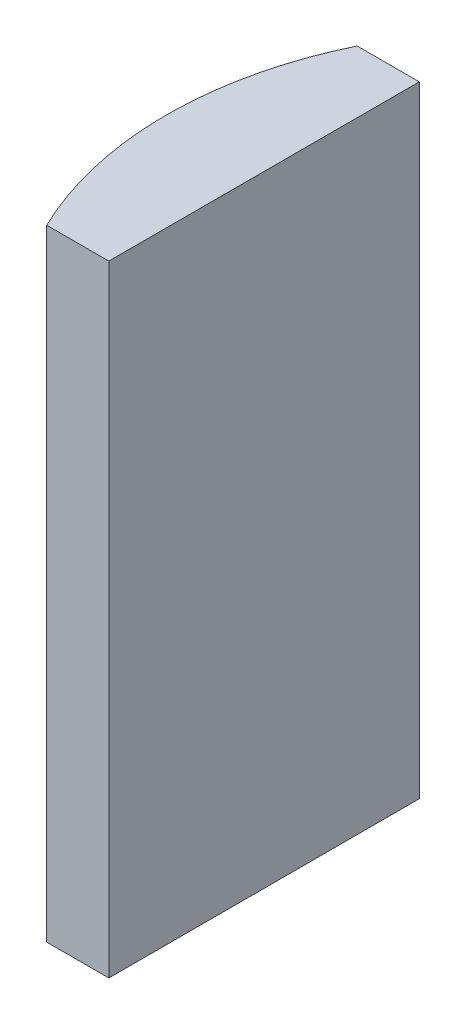
ISO-10303-21;
HEADER;
FILE_DESCRIPTION(('STEP AP214'),'2;1');
FILE_NAME('part.step','',(''),(''),'','','');
FILE_SCHEMA(('AUTOMOTIVE_DESIGN { 1 0 10303 214 1 1 1 1 }'));
ENDSEC;
DATA;
#1=APPLICATION_CONTEXT('core data for automotive mechanical design processes');
#2=APPLICATION_PROTOCOL_DEFINITION('international standard','automotive_design',2000,#1);
#3=PRODUCT_CONTEXT('',#1,'mechanical');
#4=PRODUCT('Part','Part','',(#3));
#5=PRODUCT_RELATED_PRODUCT_CATEGORY('part','',(#4));
#6=PRODUCT_DEFINITION_FORMATION('','',#4);
#7=PRODUCT_DEFINITION_CONTEXT('part definition',#1,'design');
#8=PRODUCT_DEFINITION('design','',#6,#7);
#9=PRODUCT_DEFINITION_SHAPE('','',#8);
#10=(LENGTH_UNIT() NAMED_UNIT(*) SI_UNIT(.MILLI.,.METRE.));
#11=(NAMED_UNIT(*) PLANE_ANGLE_UNIT() SI_UNIT($,.RADIAN.));
#12=(NAMED_UNIT(*) SI_UNIT($,.STERADIAN.) SOLID_ANGLE_UNIT());
#13=UNCERTAINTY_MEASURE_WITH_UNIT(LENGTH_MEASURE(1.E-05),#10,'distance_accuracy_value','');
#14=(GEOMETRIC_REPRESENTATION_CONTEXT(3) GLOBAL_UNCERTAINTY_ASSIGNED_CONTEXT((#13)) GLOBAL_UNIT_ASSIGNED_CONTEXT((#10,
#11,#12)) REPRESENTATION_CONTEXT('',''));
#15=CARTESIAN_POINT('',(0.,0.,0.));
#16=DIRECTION('',(0.,0.,1.));
#17=DIRECTION('',(1.,0.,0.));
#18=AXIS2_PLACEMENT_3D('',#15,#16,#17);
#19=CARTESIAN_POINT('',(4.35520433485127,20.,0.));
#20=DIRECTION('',(0.,-1.,0.));
#21=DIRECTION('',(0.,0.,-1.));
#22=AXIS2_PLACEMENT_3D('',#19,#20,#21);
#23=CYLINDRICAL_SURFACE('',#22,11.45);
#24=CARTESIAN_POINT('',(4.35520433485127,0.,0.));
#25=DIRECTION('',(0.,1.,0.));
#26=DIRECTION('',(0.,0.,1.));
#27=AXIS2_PLACEMENT_3D('',#24,#25,#26);
#28=CIRCLE('',#27,11.45);
#29=CARTESIAN_POINT('',(-5.94540244339243,0.,-5.));
#30=VERTEX_POINT('',#29);
#31=CARTESIAN_POINT('',(-5.94540244339243,0.,5.));
#32=VERTEX_POINT('',#31);
#33=EDGE_CURVE('E100',#30,#32,#28,.T.);
#34=ORIENTED_EDGE('',*,*,#33,.T.);
#35=DIRECTION('',(0.,-1.,0.));
#36=VECTOR('',#35,1.);
#37=CARTESIAN_POINT('',(-5.94540244339243,20.,5.));
#38=LINE('',#37,#36);
#39=CARTESIAN_POINT('',(-5.94540244339243,20.,5.));
#40=VERTEX_POINT('',#39);
#41=EDGE_CURVE('E11',#40,#32,#38,.T.);
#42=ORIENTED_EDGE('',*,*,#41,.F.);
#43=CARTESIAN_POINT('',(4.35520433485127,20.,0.));
#44=DIRECTION('',(0.,1.,0.));
#45=DIRECTION('',(0.,0.,1.));
#46=AXIS2_PLACEMENT_3D('',#43,#44,#45);
#47=CIRCLE('',#46,11.45);
#48=CARTESIAN_POINT('',(-5.94540244339243,20.,-5.));
#49=VERTEX_POINT('',#48);
#50=EDGE_CURVE('E88',#49,#40,#47,.T.);
#51=ORIENTED_EDGE('',*,*,#50,.F.);
#52=DIRECTION('',(0.,-1.,0.));
#53=VECTOR('',#52,1.);
#54=CARTESIAN_POINT('',(-5.94540244339243,20.,-5.));
#55=LINE('',#54,#53);
#56=EDGE_CURVE('E96',#49,#30,#55,.T.);
#57=ORIENTED_EDGE('',*,*,#56,.T.);
#58=EDGE_LOOP('',(#34,#42,#51,#57));
#59=FACE_BOUND('',#58,.T.);
#60=ADVANCED_FACE('F37',(#59),#23,.T.);
#61=CARTESIAN_POINT('',(-5.94540244339243,20.,5.));
#62=DIRECTION('',(0.,0.,-1.));
#63=DIRECTION('',(-1.,0.,0.));
#64=AXIS2_PLACEMENT_3D('',#61,#62,#63);
#65=PLANE('',#64);
#66=DIRECTION('',(1.,0.,0.));
#67=VECTOR('',#66,1.);
#68=CARTESIAN_POINT('',(-5.94540244339243,0.,5.));
#69=LINE('',#68,#67);
#70=CARTESIAN_POINT('',(-3.94479566514873,0.,5.));
#71=VERTEX_POINT('',#70);
#72=EDGE_CURVE('E92',#32,#71,#69,.T.);
#73=ORIENTED_EDGE('',*,*,#72,.T.);
#74=DIRECTION('',(0.,-1.,0.));
#75=VECTOR('',#74,1.);
#76=CARTESIAN_POINT('',(-3.94479566514873,20.,5.));
#77=LINE('',#76,#75);
#78=CARTESIAN_POINT('',(-3.94479566514873,20.,5.));
#79=VERTEX_POINT('',#78);
#80=EDGE_CURVE('E45',#79,#71,#77,.T.);
#81=ORIENTED_EDGE('',*,*,#80,.F.);
#82=DIRECTION('',(1.,0.,0.));
#83=VECTOR('',#82,1.);
#84=CARTESIAN_POINT('',(-5.94540244339243,20.,5.));
#85=LINE('',#84,#83);
#86=EDGE_CURVE('E83',#40,#79,#85,.T.);
#87=ORIENTED_EDGE('',*,*,#86,.F.);
#88=ORIENTED_EDGE('',*,*,#41,.T.);
#89=EDGE_LOOP('',(#73,#81,#87,#88));
#90=FACE_BOUND('',#89,.T.);
#91=ADVANCED_FACE('F91',(#90),#65,.F.);
#92=CARTESIAN_POINT('',(-3.94479566514874,20.,-5.));
#93=DIRECTION('',(-1.,0.,0.));
#94=DIRECTION('',(0.,0.,1.));
#95=AXIS2_PLACEMENT_3D('',#92,#93,#94);
#96=PLANE('',#95);
#97=DIRECTION('',(0.,0.,-1.));
#98=VECTOR('',#97,1.);
#99=CARTESIAN_POINT('',(-3.94479566514874,0.,-5.));
#100=LINE('',#99,#98);
#101=CARTESIAN_POINT('',(-3.94479566514874,0.,-5.));
#102=VERTEX_POINT('',#101);
#103=EDGE_CURVE('E70',#71,#102,#100,.T.);
#104=ORIENTED_EDGE('',*,*,#103,.T.);
#105=DIRECTION('',(0.,-1.,0.));
#106=VECTOR('',#105,1.);
#107=CARTESIAN_POINT('',(-3.94479566514874,20.,-5.));
#108=LINE('',#107,#106);
#109=CARTESIAN_POINT('',(-3.94479566514874,20.,-5.));
#110=VERTEX_POINT('',#109);
#111=EDGE_CURVE('E93',#110,#102,#108,.T.);
#112=ORIENTED_EDGE('',*,*,#111,.F.);
#113=DIRECTION('',(0.,0.,-1.));
#114=VECTOR('',#113,1.);
#115=CARTESIAN_POINT('',(-3.94479566514874,20.,-5.));
#116=LINE('',#115,#114);
#117=EDGE_CURVE('E86',#79,#110,#116,.T.);
#118=ORIENTED_EDGE('',*,*,#117,.F.);
#119=ORIENTED_EDGE('',*,*,#80,.T.);
#120=EDGE_LOOP('',(#104,#112,#118,#119));
#121=FACE_BOUND('',#120,.T.);
#122=ADVANCED_FACE('F94',(#121),#96,.F.);
#123=CARTESIAN_POINT('',(-5.94540244339243,20.,-5.));
#124=DIRECTION('',(0.,0.,1.));
#125=DIRECTION('',(1.,0.,0.));
#126=AXIS2_PLACEMENT_3D('',#123,#124,#125);
#127=PLANE('',#126);
#128=DIRECTION('',(-1.,0.,0.));
#129=VECTOR('',#128,1.);
#130=CARTESIAN_POINT('',(-5.94540244339243,0.,-5.));
#131=LINE('',#130,#129);
#132=EDGE_CURVE('E76',#102,#30,#131,.T.);
#133=ORIENTED_EDGE('',*,*,#132,.T.);
#134=ORIENTED_EDGE('',*,*,#56,.F.);
#135=DIRECTION('',(-1.,0.,0.));
#136=VECTOR('',#135,1.);
#137=CARTESIAN_POINT('',(-5.94540244339243,20.,-5.));
#138=LINE('',#137,#136);
#139=EDGE_CURVE('E53',#110,#49,#138,.T.);
#140=ORIENTED_EDGE('',*,*,#139,.F.);
#141=ORIENTED_EDGE('',*,*,#111,.T.);
#142=EDGE_LOOP('',(#133,#134,#140,#141));
#143=FACE_BOUND('',#142,.T.);
#144=ADVANCED_FACE('F107',(#143),#127,.F.);
#145=CARTESIAN_POINT('',(4.35520433485127,20.,0.));
#146=DIRECTION('',(0.,1.,0.));
#147=DIRECTION('',(0.,0.,1.));
#148=AXIS2_PLACEMENT_3D('',#145,#146,#147);
#149=PLANE('',#148);
#150=ORIENTED_EDGE('',*,*,#50,.T.);
#151=ORIENTED_EDGE('',*,*,#86,.T.);
#152=ORIENTED_EDGE('',*,*,#117,.T.);
#153=ORIENTED_EDGE('',*,*,#139,.T.);
#154=EDGE_LOOP('',(#150,#151,#152,#153));
#155=FACE_BOUND('',#154,.T.);
#156=ADVANCED_FACE('F84',(#155),#149,.T.);
#157=CARTESIAN_POINT('',(4.35520433485127,0.,0.));
#158=DIRECTION('',(0.,1.,0.));
#159=DIRECTION('',(0.,0.,1.));
#160=AXIS2_PLACEMENT_3D('',#157,#158,#159);
#161=PLANE('',#160);
#162=ORIENTED_EDGE('',*,*,#33,.F.);
#163=ORIENTED_EDGE('',*,*,#132,.F.);
#164=ORIENTED_EDGE('',*,*,#103,.F.);
#165=ORIENTED_EDGE('',*,*,#72,.F.);
#166=EDGE_LOOP('',(#162,#163,#164,#165));
#167=FACE_BOUND('',#166,.T.);
#168=ADVANCED_FACE('F110',(#167),#161,.F.);
#169=CLOSED_SHELL('',(#60,#91,#122,#144,#156,#168));
#170=MANIFOLD_SOLID_BREP('B2',#169);
#171=ADVANCED_BREP_SHAPE_REPRESENTATION('',(#18,#170),#14);
#172=SHAPE_DEFINITION_REPRESENTATION(#9,#171);
ENDSEC;
END-ISO-10303-21;
